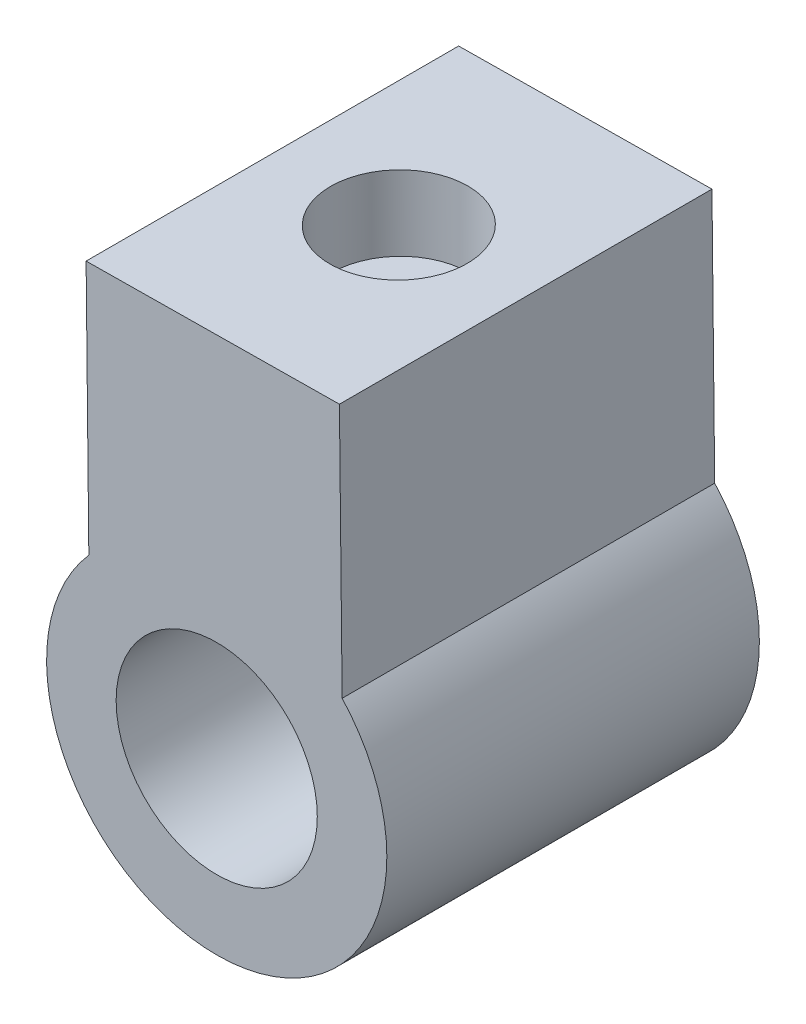
ISO-10303-21;
HEADER;
FILE_DESCRIPTION(('STEP AP214'),'2;1');
FILE_NAME('part.step','',(''),(''),'','','');
FILE_SCHEMA(('AUTOMOTIVE_DESIGN { 1 0 10303 214 1 1 1 1 }'));
ENDSEC;
DATA;
#1=APPLICATION_CONTEXT('core data for automotive mechanical design processes');
#2=APPLICATION_PROTOCOL_DEFINITION('international standard','automotive_design',2000,#1);
#3=PRODUCT_CONTEXT('',#1,'mechanical');
#4=PRODUCT('Part','Part','',(#3));
#5=PRODUCT_RELATED_PRODUCT_CATEGORY('part','',(#4));
#6=PRODUCT_DEFINITION_FORMATION('','',#4);
#7=PRODUCT_DEFINITION_CONTEXT('part definition',#1,'design');
#8=PRODUCT_DEFINITION('design','',#6,#7);
#9=PRODUCT_DEFINITION_SHAPE('','',#8);
#10=(LENGTH_UNIT() NAMED_UNIT(*) SI_UNIT(.MILLI.,.METRE.));
#11=(NAMED_UNIT(*) PLANE_ANGLE_UNIT() SI_UNIT($,.RADIAN.));
#12=(NAMED_UNIT(*) SI_UNIT($,.STERADIAN.) SOLID_ANGLE_UNIT());
#13=UNCERTAINTY_MEASURE_WITH_UNIT(LENGTH_MEASURE(1.E-05),#10,'distance_accuracy_value','');
#14=(GEOMETRIC_REPRESENTATION_CONTEXT(3) GLOBAL_UNCERTAINTY_ASSIGNED_CONTEXT((#13)) GLOBAL_UNIT_ASSIGNED_CONTEXT((#10,
#11,#12)) REPRESENTATION_CONTEXT('',''));
#15=CARTESIAN_POINT('',(0.,0.,0.));
#16=DIRECTION('',(0.,0.,1.));
#17=DIRECTION('',(1.,0.,0.));
#18=AXIS2_PLACEMENT_3D('',#15,#16,#17);
#19=CARTESIAN_POINT('',(0.877948062338801,0.00945442115652128,15.));
#20=DIRECTION('',(-0.999942021834013,-0.0107681461034695,0.));
#21=DIRECTION('',(0.0107681461034695,-0.999942021834013,0.));
#22=AXIS2_PLACEMENT_3D('',#19,#20,#21);
#23=PLANE('',#22);
#24=DIRECTION('',(-0.0107681461034695,0.999942021834013,0.));
#25=VECTOR('',#24,1.);
#26=CARTESIAN_POINT('',(0.877948062338801,0.00945442115652128,0.));
#27=LINE('',#26,#25);
#28=CARTESIAN_POINT('',(0.810681556908006,6.25589691885864,0.));
#29=VERTEX_POINT('',#28);
#30=CARTESIAN_POINT('',(0.700840098246295,16.4558969188586,0.));
#31=VERTEX_POINT('',#30);
#32=EDGE_CURVE('E104',#29,#31,#27,.T.);
#33=ORIENTED_EDGE('',*,*,#32,.F.);
#34=DIRECTION('',(0.,0.,-1.));
#35=VECTOR('',#34,1.);
#36=CARTESIAN_POINT('',(0.810681556908006,6.25589691885864,15.));
#37=LINE('',#36,#35);
#38=CARTESIAN_POINT('',(0.810681556908006,6.25589691885864,15.));
#39=VERTEX_POINT('',#38);
#40=EDGE_CURVE('E11',#39,#29,#37,.T.);
#41=ORIENTED_EDGE('',*,*,#40,.F.);
#42=DIRECTION('',(-0.0107681461034695,0.999942021834013,0.));
#43=VECTOR('',#42,1.);
#44=CARTESIAN_POINT('',(0.877948062338801,0.00945442115652128,15.));
#45=LINE('',#44,#43);
#46=CARTESIAN_POINT('',(0.700840098246295,16.4558969188586,15.));
#47=VERTEX_POINT('',#46);
#48=EDGE_CURVE('E88',#39,#47,#45,.T.);
#49=ORIENTED_EDGE('',*,*,#48,.T.);
#50=DIRECTION('',(0.,0.,-1.));
#51=VECTOR('',#50,1.);
#52=CARTESIAN_POINT('',(0.700840098246295,16.4558969188586,15.));
#53=LINE('',#52,#51);
#54=EDGE_CURVE('E56',#47,#31,#53,.T.);
#55=ORIENTED_EDGE('',*,*,#54,.T.);
#56=EDGE_LOOP('',(#33,#41,#49,#55));
#57=FACE_BOUND('',#56,.T.);
#58=ADVANCED_FACE('F35',(#57),#23,.T.);
#59=CARTESIAN_POINT('',(5.9599209389951,1.73839387116035,15.));
#60=DIRECTION('',(0.,0.,-1.));
#61=DIRECTION('',(-1.,0.,0.));
#62=AXIS2_PLACEMENT_3D('',#59,#60,#61);
#63=CYLINDRICAL_SURFACE('',#62,6.85);
#64=CARTESIAN_POINT('',(5.9599209389951,1.73839387116035,0.));
#65=DIRECTION('',(0.,0.,1.));
#66=DIRECTION('',(1.,0.,0.));
#67=AXIS2_PLACEMENT_3D('',#64,#65,#66);
#68=CIRCLE('',#67,6.85);
#69=CARTESIAN_POINT('',(11.010681556908,6.36573837752035,0.));
#70=VERTEX_POINT('',#69);
#71=EDGE_CURVE('E94',#29,#70,#68,.T.);
#72=ORIENTED_EDGE('',*,*,#71,.T.);
#73=DIRECTION('',(0.,0.,-1.));
#74=VECTOR('',#73,1.);
#75=CARTESIAN_POINT('',(11.010681556908,6.36573837752035,15.));
#76=LINE('',#75,#74);
#77=CARTESIAN_POINT('',(11.010681556908,6.36573837752035,15.));
#78=VERTEX_POINT('',#77);
#79=EDGE_CURVE('E48',#78,#70,#76,.T.);
#80=ORIENTED_EDGE('',*,*,#79,.F.);
#81=CARTESIAN_POINT('',(5.9599209389951,1.73839387116035,15.));
#82=DIRECTION('',(0.,0.,1.));
#83=DIRECTION('',(1.,0.,0.));
#84=AXIS2_PLACEMENT_3D('',#81,#82,#83);
#85=CIRCLE('',#84,6.85);
#86=EDGE_CURVE('E82',#39,#78,#85,.T.);
#87=ORIENTED_EDGE('',*,*,#86,.F.);
#88=ORIENTED_EDGE('',*,*,#40,.T.);
#89=EDGE_LOOP('',(#72,#80,#87,#88));
#90=FACE_BOUND('',#89,.T.);
#91=ADVANCED_FACE('F92',(#90),#63,.T.);
#92=CARTESIAN_POINT('',(11.0779480623388,0.119295879818234,15.));
#93=DIRECTION('',(-0.999942021834013,-0.0107681461034696,0.));
#94=DIRECTION('',(0.0107681461034696,-0.999942021834013,0.));
#95=AXIS2_PLACEMENT_3D('',#92,#93,#94);
#96=PLANE('',#95);
#97=DIRECTION('',(-0.0107681461034696,0.999942021834013,0.));
#98=VECTOR('',#97,1.);
#99=CARTESIAN_POINT('',(11.0779480623388,0.119295879818234,0.));
#100=LINE('',#99,#98);
#101=CARTESIAN_POINT('',(10.9008400982463,16.5657383775204,0.));
#102=VERTEX_POINT('',#101);
#103=EDGE_CURVE('E108',#70,#102,#100,.T.);
#104=ORIENTED_EDGE('',*,*,#103,.T.);
#105=DIRECTION('',(0.,0.,-1.));
#106=VECTOR('',#105,1.);
#107=CARTESIAN_POINT('',(10.9008400982463,16.5657383775204,15.));
#108=LINE('',#107,#106);
#109=CARTESIAN_POINT('',(10.9008400982463,16.5657383775204,15.));
#110=VERTEX_POINT('',#109);
#111=EDGE_CURVE('E70',#110,#102,#108,.T.);
#112=ORIENTED_EDGE('',*,*,#111,.F.);
#113=DIRECTION('',(-0.0107681461034696,0.999942021834013,0.));
#114=VECTOR('',#113,1.);
#115=CARTESIAN_POINT('',(11.0779480623388,0.119295879818234,15.));
#116=LINE('',#115,#114);
#117=EDGE_CURVE('E87',#78,#110,#116,.T.);
#118=ORIENTED_EDGE('',*,*,#117,.F.);
#119=ORIENTED_EDGE('',*,*,#79,.T.);
#120=EDGE_LOOP('',(#104,#112,#118,#119));
#121=FACE_BOUND('',#120,.T.);
#122=ADVANCED_FACE('F98',(#121),#96,.F.);
#123=CARTESIAN_POINT('',(-0.177107964092502,16.4464424977021,15.));
#124=DIRECTION('',(-0.0107681461034692,0.999942021834013,0.));
#125=DIRECTION('',(-0.999942021834013,-0.0107681461034692,0.));
#126=AXIS2_PLACEMENT_3D('',#123,#124,#125);
#127=PLANE('',#126);
#128=CARTESIAN_POINT('',(5.79157778210196,16.510717904433,7.49932369738016));
#129=DIRECTION('',(-0.0107681461034692,0.999942021834013,0.));
#130=DIRECTION('',(-0.999942021834013,-0.0107681461034692,0.));
#131=AXIS2_PLACEMENT_3D('',#128,#129,#130);
#132=CIRCLE('',#131,2.75);
#133=CARTESIAN_POINT('',(3.04173722205843,16.4811055026485,7.49932369738016));
#134=VERTEX_POINT('',#133);
#135=EDGE_CURVE('E116',#134,#134,#132,.T.);
#136=ORIENTED_EDGE('',*,*,#135,.F.);
#137=EDGE_LOOP('',(#136));
#138=FACE_BOUND('',#137,.T.);
#139=DIRECTION('',(0.999942021834013,0.0107681461034692,0.));
#140=VECTOR('',#139,1.);
#141=CARTESIAN_POINT('',(-0.177107964092502,16.4464424977021,0.));
#142=LINE('',#141,#140);
#143=EDGE_CURVE('E110',#31,#102,#142,.T.);
#144=ORIENTED_EDGE('',*,*,#143,.F.);
#145=ORIENTED_EDGE('',*,*,#54,.F.);
#146=DIRECTION('',(0.999942021834013,0.0107681461034692,0.));
#147=VECTOR('',#146,1.);
#148=CARTESIAN_POINT('',(-0.177107964092502,16.4464424977021,15.));
#149=LINE('',#148,#147);
#150=EDGE_CURVE('E99',#47,#110,#149,.T.);
#151=ORIENTED_EDGE('',*,*,#150,.T.);
#152=ORIENTED_EDGE('',*,*,#111,.T.);
#153=EDGE_LOOP('',(#144,#145,#151,#152));
#154=FACE_BOUND('',#153,.T.);
#155=ADVANCED_FACE('F151',(#138,#154),#127,.T.);
#156=CARTESIAN_POINT('',(0.,0.,15.));
#157=DIRECTION('',(0.,0.,1.));
#158=DIRECTION('',(1.,0.,0.));
#159=AXIS2_PLACEMENT_3D('',#156,#157,#158);
#160=PLANE('',#159);
#161=CARTESIAN_POINT('',(5.9599209389951,1.73839387116035,15.));
#162=DIRECTION('',(0.,0.,-1.));
#163=DIRECTION('',(-1.,0.,0.));
#164=AXIS2_PLACEMENT_3D('',#161,#162,#163);
#165=CIRCLE('',#164,4.05);
#166=CARTESIAN_POINT('',(1.9099209389951,1.73839387116035,15.));
#167=VERTEX_POINT('',#166);
#168=EDGE_CURVE('E127',#167,#167,#165,.T.);
#169=ORIENTED_EDGE('',*,*,#168,.T.);
#170=EDGE_LOOP('',(#169));
#171=FACE_BOUND('',#170,.T.);
#172=ORIENTED_EDGE('',*,*,#48,.F.);
#173=ORIENTED_EDGE('',*,*,#86,.T.);
#174=ORIENTED_EDGE('',*,*,#117,.T.);
#175=ORIENTED_EDGE('',*,*,#150,.F.);
#176=EDGE_LOOP('',(#172,#173,#174,#175));
#177=FACE_BOUND('',#176,.T.);
#178=ADVANCED_FACE('F84',(#171,#177),#160,.T.);
#179=CARTESIAN_POINT('',(0.,0.,0.));
#180=DIRECTION('',(0.,0.,1.));
#181=DIRECTION('',(1.,0.,0.));
#182=AXIS2_PLACEMENT_3D('',#179,#180,#181);
#183=PLANE('',#182);
#184=CARTESIAN_POINT('',(5.9599209389951,1.73839387116035,0.));
#185=DIRECTION('',(0.,0.,-1.));
#186=DIRECTION('',(-1.,0.,0.));
#187=AXIS2_PLACEMENT_3D('',#184,#185,#186);
#188=CIRCLE('',#187,4.05);
#189=CARTESIAN_POINT('',(1.9099209389951,1.73839387116035,0.));
#190=VERTEX_POINT('',#189);
#191=EDGE_CURVE('E124',#190,#190,#188,.T.);
#192=ORIENTED_EDGE('',*,*,#191,.F.);
#193=EDGE_LOOP('',(#192));
#194=FACE_BOUND('',#193,.T.);
#195=ORIENTED_EDGE('',*,*,#32,.T.);
#196=ORIENTED_EDGE('',*,*,#143,.T.);
#197=ORIENTED_EDGE('',*,*,#103,.F.);
#198=ORIENTED_EDGE('',*,*,#71,.F.);
#199=EDGE_LOOP('',(#195,#196,#197,#198));
#200=FACE_BOUND('',#199,.T.);
#201=ADVANCED_FACE('F150',(#194,#200),#183,.F.);
#202=CARTESIAN_POINT('',(5.82388222041237,13.510891838931,7.49932369738016));
#203=DIRECTION('',(-0.0107681461034692,0.999942021834013,0.));
#204=DIRECTION('',(-0.999942021834013,-0.0107681461034692,0.));
#205=AXIS2_PLACEMENT_3D('',#202,#203,#204);
#206=CYLINDRICAL_SURFACE('',#205,2.75);
#207=CARTESIAN_POINT('',(5.82388222041237,13.510891838931,7.49932369738016));
#208=DIRECTION('',(-0.0107681461034692,0.999942021834013,0.));
#209=DIRECTION('',(-0.999942021834013,-0.0107681461034692,0.));
#210=AXIS2_PLACEMENT_3D('',#207,#208,#209);
#211=CIRCLE('',#210,2.75);
#212=CARTESIAN_POINT('',(3.07404166036884,13.4812794371464,7.49932369738016));
#213=VERTEX_POINT('',#212);
#214=EDGE_CURVE('E106',#213,#213,#211,.T.);
#215=ORIENTED_EDGE('',*,*,#214,.F.);
#216=EDGE_LOOP('',(#215));
#217=FACE_BOUND('',#216,.T.);
#218=ORIENTED_EDGE('',*,*,#135,.T.);
#219=EDGE_LOOP('',(#218));
#220=FACE_BOUND('',#219,.T.);
#221=ADVANCED_FACE('F164',(#217,#220),#206,.F.);
#222=CARTESIAN_POINT('',(5.82388222041237,13.510891838931,7.49932369738016));
#223=DIRECTION('',(-0.0107681461034692,0.999942021834013,0.));
#224=DIRECTION('',(-0.999942021834013,-0.0107681461034692,0.));
#225=AXIS2_PLACEMENT_3D('',#222,#223,#224);
#226=PLANE('',#225);
#227=CARTESIAN_POINT('',(5.82388222041237,13.510891838931,7.49932369738016));
#228=DIRECTION('',(-0.0107681461034692,0.999942021834013,0.));
#229=DIRECTION('',(-0.999942021834013,-0.0107681461034692,0.));
#230=AXIS2_PLACEMENT_3D('',#227,#228,#229);
#231=CIRCLE('',#230,1.35);
#232=CARTESIAN_POINT('',(4.47396049093645,13.4963548416913,7.49932369738016));
#233=VERTEX_POINT('',#232);
#234=EDGE_CURVE('E119',#233,#233,#231,.T.);
#235=ORIENTED_EDGE('',*,*,#234,.F.);
#236=EDGE_LOOP('',(#235));
#237=FACE_BOUND('',#236,.T.);
#238=ORIENTED_EDGE('',*,*,#214,.T.);
#239=EDGE_LOOP('',(#238));
#240=FACE_BOUND('',#239,.T.);
#241=ADVANCED_FACE('F143',(#237,#240),#226,.T.);
#242=CARTESIAN_POINT('',(5.92079553534359,4.51141364242486,7.49932369738016));
#243=DIRECTION('',(-0.0107681461034692,0.999942021834013,0.));
#244=DIRECTION('',(-0.999942021834013,-0.0107681461034692,0.));
#245=AXIS2_PLACEMENT_3D('',#242,#243,#244);
#246=CYLINDRICAL_SURFACE('',#245,1.35);
#247=CARTESIAN_POINT('',(4.55965545703517,5.53862499308327,7.49932369738016));
#248=CARTESIAN_POINT('',(4.55965510420086,5.53862474127262,7.42582997608543));
#249=CARTESIAN_POINT('',(4.5656536761518,5.54085125079065,7.3523383857854));
#250=CARTESIAN_POINT('',(4.5894095877851,5.54947700919048,7.20753366745371));
#251=CARTESIAN_POINT('',(4.60716888651309,5.55587695326034,7.13622090443141));
#252=CARTESIAN_POINT('',(4.65375614026992,5.57206502904458,6.99789633023835));
#253=CARTESIAN_POINT('',(4.68256214021839,5.58184643639846,6.93087629375514));
#254=CARTESIAN_POINT('',(4.75035755115458,5.60371669743612,6.80261676957245));
#255=CARTESIAN_POINT('',(4.78934922364908,5.61580606339119,6.7413785697199));
#256=CARTESIAN_POINT('',(4.87807305998835,5.64150918504896,6.62399403053869));
#257=CARTESIAN_POINT('',(4.92814113790953,5.65516213361359,6.56811011098215));
#258=CARTESIAN_POINT('',(5.03689274832382,5.68220610343566,6.46537700643925));
#259=CARTESIAN_POINT('',(5.09557769906808,5.69559708116338,6.41852931166753));
#260=CARTESIAN_POINT('',(5.22185002390832,5.72110699715296,6.33398609189747));
#261=CARTESIAN_POINT('',(5.28963401171768,5.73318216504214,6.29656985502593));
#262=CARTESIAN_POINT('',(5.43100758328235,5.75434328910094,6.23379662913197));
#263=CARTESIAN_POINT('',(5.5045956059673,5.76343004566626,6.20843641029591));
#264=CARTESIAN_POINT('',(5.65279075410044,5.77739319687451,6.17137700700836));
#265=CARTESIAN_POINT('',(5.72727414917353,5.78240461001206,6.15923478538595));
#266=CARTESIAN_POINT('',(5.87737706069206,5.78824839222784,6.14755198490366));
#267=CARTESIAN_POINT('',(5.95299627446747,5.78908185549275,6.14800810638943));
#268=CARTESIAN_POINT('',(6.10003123784814,5.78661136497161,6.16122877788216));
#269=CARTESIAN_POINT('',(6.17149458437434,5.78347057391281,6.17350329462601));
#270=CARTESIAN_POINT('',(6.31132488105465,5.77372905376202,6.20920598834808));
#271=CARTESIAN_POINT('',(6.37969163022283,5.76712810043539,6.23263488817329));
#272=CARTESIAN_POINT('',(6.51239060638969,5.75109915732117,6.29024531274987));
#273=CARTESIAN_POINT('',(6.57666183540844,5.74163691468585,6.32455737941933));
#274=CARTESIAN_POINT('',(6.69869940162426,5.72092363124403,6.40285217092214));
#275=CARTESIAN_POINT('',(6.75646394063292,5.70967209801117,6.44683755920686));
#276=CARTESIAN_POINT('',(6.86669839615981,5.68599854067534,6.54564600620604));
#277=CARTESIAN_POINT('',(6.91879419468408,5.67354638322898,6.60087981090716));
#278=CARTESIAN_POINT('',(7.01310141271028,5.64936395512217,6.71938074722615));
#279=CARTESIAN_POINT('',(7.055311301711,5.63763379644594,6.78264912039202));
#280=CARTESIAN_POINT('',(7.12917644645206,5.61613148052337,6.91663878334878));
#281=CARTESIAN_POINT('',(7.16066855364423,5.6063904209291,6.98745542484933));
#282=CARTESIAN_POINT('',(7.21111977590996,5.59036873416873,7.13378490168415));
#283=CARTESIAN_POINT('',(7.23008404578376,5.58408668390942,7.20929579147622));
#284=CARTESIAN_POINT('',(7.25417635304952,5.57604394283852,7.35928559824918));
#285=CARTESIAN_POINT('',(7.25988037376044,5.57409520096036,7.43366192333576));
#286=CARTESIAN_POINT('',(7.25892056266614,5.57442062649209,7.58231738613649));
#287=CARTESIAN_POINT('',(7.25225895799298,5.5766940334647,7.65659653894087));
#288=CARTESIAN_POINT('',(7.22727977480401,5.58501092709488,7.80031783063278));
#289=CARTESIAN_POINT('',(7.20936589451617,5.59092370206521,7.86983856664732));
#290=CARTESIAN_POINT('',(7.16288101526811,5.60568978731981,8.00488483200678));
#291=CARTESIAN_POINT('',(7.13430813958956,5.6145436154022,8.07040965543031));
#292=CARTESIAN_POINT('',(7.06630733890812,5.63450716099197,8.19787686933818));
#293=CARTESIAN_POINT('',(7.02656769476853,5.64567880419434,8.25964297917356));
#294=CARTESIAN_POINT('',(6.93772371931179,5.66885262444816,8.37586034961971));
#295=CARTESIAN_POINT('',(6.88861665855941,5.68085504291606,8.43030947033833));
#296=CARTESIAN_POINT('',(6.77967999847886,5.70497258960596,8.53301137883945));
#297=CARTESIAN_POINT('',(6.71945279160412,5.71706614587333,8.58084870442373));
#298=CARTESIAN_POINT('',(6.59152808194401,5.73936646924341,8.66578662536556));
#299=CARTESIAN_POINT('',(6.52383087545746,5.74957331114005,8.70288764636916));
#300=CARTESIAN_POINT('',(6.38326969420723,5.76682391213939,8.76494656877891));
#301=CARTESIAN_POINT('',(6.31044570054317,5.77388955766731,8.78998859693741));
#302=CARTESIAN_POINT('',(6.16135091134968,5.78407049933388,8.82738678086156));
#303=CARTESIAN_POINT('',(6.0850813625849,5.78718721271158,8.83974748754528));
#304=CARTESIAN_POINT('',(5.9350998092778,5.78897979713782,8.85102658544191));
#305=CARTESIAN_POINT('',(5.86143493263638,5.78785646690712,8.85054639310394));
#306=CARTESIAN_POINT('',(5.71533450423204,5.78166266230611,8.83764543328358));
#307=CARTESIAN_POINT('',(5.64289885751743,5.7765924942399,8.82522559238954));
#308=CARTESIAN_POINT('',(5.50240481445335,5.76307882409318,8.78919047545674));
#309=CARTESIAN_POINT('',(5.4342965129665,5.75468794104471,8.76574880689891));
#310=CARTESIAN_POINT('',(5.30298629457256,5.73531102071603,8.70850184407956));
#311=CARTESIAN_POINT('',(5.23978527975757,5.72432450778238,8.67469464997987));
#312=CARTESIAN_POINT('',(5.11749633014654,5.70031897502932,8.59621866672068));
#313=CARTESIAN_POINT('',(5.05865106133177,5.68723924759382,8.55119053345322));
#314=CARTESIAN_POINT('',(4.94916281054254,5.66064428297103,8.45216178875928));
#315=CARTESIAN_POINT('',(4.89852247530048,5.64712890693194,8.39815829341193));
#316=CARTESIAN_POINT('',(4.80485517722728,5.62050539776733,8.28018044188763));
#317=CARTESIAN_POINT('',(4.76220407332639,5.60743394603112,8.21589841071047));
#318=CARTESIAN_POINT('',(4.68831929812301,5.58378612235685,8.08065780864474));
#319=CARTESIAN_POINT('',(4.65708257147922,5.57320908299662,8.00970103082163));
#320=CARTESIAN_POINT('',(4.60824635774421,5.5562619850998,7.8664528603853));
#321=CARTESIAN_POINT('',(4.590084260207,5.54972036754966,7.79437402472563));
#322=CARTESIAN_POINT('',(4.56579109249101,5.54090274491742,7.64797010207885));
#323=CARTESIAN_POINT('',(4.55965581384649,5.53862524773223,7.57364581007707));
#324=CARTESIAN_POINT('',(4.55965545703517,5.53862499308327,7.49932369738016));
#325=B_SPLINE_CURVE_WITH_KNOTS('',3,(#247,#248,#249,#250,#251,#252,#253,#254,#255,#256,#257,
#258,#259,#260,#261,#262,#263,#264,#265,#266,#267,#268,#269,#270,#271,#272,#273,#274,#275,#276,
#277,#278,#279,#280,#281,#282,#283,#284,#285,#286,#287,#288,#289,#290,#291,#292,#293,#294,#295,
#296,#297,#298,#299,#300,#301,#302,#303,#304,#305,#306,#307,#308,#309,#310,#311,#312,#313,#314,
#315,#316,#317,#318,#319,#320,#321,#322,#323,#324),.UNSPECIFIED.,.T.,.F.,(4,2,2,2,2,2,2,2,2,2,2,
2,2,2,2,2,2,2,2,2,2,2,2,2,2,2,2,2,2,2,2,2,2,2,2,2,2,2,4),(0.,0.220205771110087,0.44044823227449,
0.660255216078592,0.880111044778412,1.10787585296604,1.33567819107393,1.56959270316972,
1.80344451407943,2.02919079832167,2.25487795751579,2.47159309179166,2.68832227195547,
2.90775619433686,3.12725061144514,3.35701349973985,3.58681193562602,3.81996647055829,
4.05302501007916,4.27575415933963,4.49844319747898,4.71356643031166,4.92872755756076,
5.15062200957102,5.37258121520969,5.60504998746379,5.83750954211676,6.06832301887904,
6.2990536351096,6.51899753310062,6.73892436350367,6.95549752435051,7.17211040341175,
7.39683522797651,7.6216324001546,7.85523383375566,8.08877269225301,8.31153849835399,
8.53422633955505),.UNSPECIFIED.);
#326=CARTESIAN_POINT('',(4.55965545703517,5.53862499308327,7.49932369738016));
#327=VERTEX_POINT('',#326);
#328=EDGE_CURVE('E38',#327,#327,#325,.T.);
#329=ORIENTED_EDGE('',*,*,#328,.T.);
#330=EDGE_LOOP('',(#329));
#331=FACE_BOUND('',#330,.T.);
#332=ORIENTED_EDGE('',*,*,#234,.T.);
#333=EDGE_LOOP('',(#332));
#334=FACE_BOUND('',#333,.T.);
#335=ADVANCED_FACE('F134',(#331,#334),#246,.F.);
#336=CARTESIAN_POINT('',(5.9599209389951,1.73839387116035,15.));
#337=DIRECTION('',(0.,0.,-1.));
#338=DIRECTION('',(-1.,0.,0.));
#339=AXIS2_PLACEMENT_3D('',#336,#337,#338);
#340=CYLINDRICAL_SURFACE('',#339,4.05);
#341=ORIENTED_EDGE('',*,*,#191,.T.);
#342=EDGE_LOOP('',(#341));
#343=FACE_BOUND('',#342,.T.);
#344=ORIENTED_EDGE('',*,*,#168,.F.);
#345=EDGE_LOOP('',(#344));
#346=FACE_BOUND('',#345,.T.);
#347=ORIENTED_EDGE('',*,*,#328,.F.);
#348=EDGE_LOOP('',(#347));
#349=FACE_BOUND('',#348,.T.);
#350=ADVANCED_FACE('F137',(#343,#346,#349),#340,.F.);
#351=CLOSED_SHELL('',(#58,#91,#122,#155,#178,#201,#221,#241,#335,#350));
#352=MANIFOLD_SOLID_BREP('B2',#351);
#353=ADVANCED_BREP_SHAPE_REPRESENTATION('',(#18,#352),#14);
#354=SHAPE_DEFINITION_REPRESENTATION(#9,#353);
ENDSEC;
END-ISO-10303-21;
